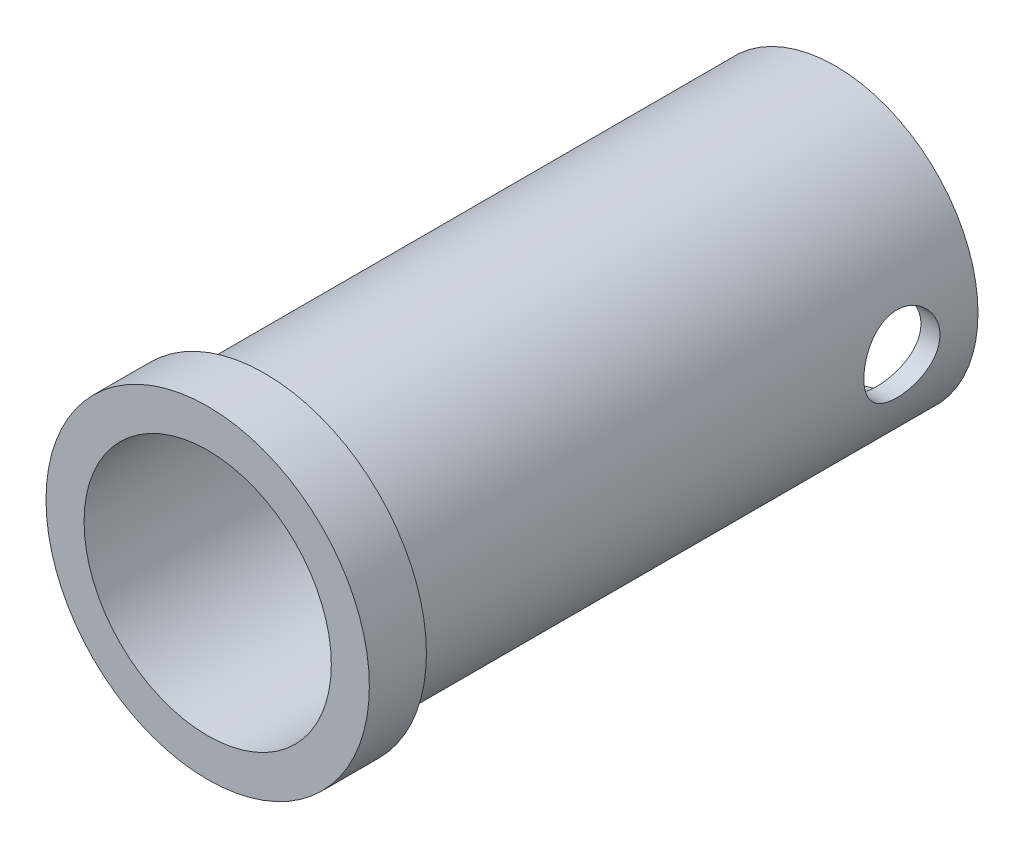
ISO-10303-21;
HEADER;
FILE_DESCRIPTION(('STEP AP214'),'2;1');
FILE_NAME('part.step','',(''),(''),'','','');
FILE_SCHEMA(('AUTOMOTIVE_DESIGN { 1 0 10303 214 1 1 1 1 }'));
ENDSEC;
DATA;
#1=APPLICATION_CONTEXT('core data for automotive mechanical design processes');
#2=APPLICATION_PROTOCOL_DEFINITION('international standard','automotive_design',2000,#1);
#3=PRODUCT_CONTEXT('',#1,'mechanical');
#4=PRODUCT('Part','Part','',(#3));
#5=PRODUCT_RELATED_PRODUCT_CATEGORY('part','',(#4));
#6=PRODUCT_DEFINITION_FORMATION('','',#4);
#7=PRODUCT_DEFINITION_CONTEXT('part definition',#1,'design');
#8=PRODUCT_DEFINITION('design','',#6,#7);
#9=PRODUCT_DEFINITION_SHAPE('','',#8);
#10=(LENGTH_UNIT() NAMED_UNIT(*) SI_UNIT(.MILLI.,.METRE.));
#11=(NAMED_UNIT(*) PLANE_ANGLE_UNIT() SI_UNIT($,.RADIAN.));
#12=(NAMED_UNIT(*) SI_UNIT($,.STERADIAN.) SOLID_ANGLE_UNIT());
#13=UNCERTAINTY_MEASURE_WITH_UNIT(LENGTH_MEASURE(1.E-05),#10,'distance_accuracy_value','');
#14=(GEOMETRIC_REPRESENTATION_CONTEXT(3) GLOBAL_UNCERTAINTY_ASSIGNED_CONTEXT((#13)) GLOBAL_UNIT_ASSIGNED_CONTEXT((#10,
#11,#12)) REPRESENTATION_CONTEXT('',''));
#15=CARTESIAN_POINT('',(0.,0.,0.));
#16=DIRECTION('',(0.,0.,1.));
#17=DIRECTION('',(1.,0.,0.));
#18=AXIS2_PLACEMENT_3D('',#15,#16,#17);
#19=CARTESIAN_POINT('',(0.,0.,0.));
#20=DIRECTION('',(0.,0.,1.));
#21=DIRECTION('',(1.,0.,0.));
#22=AXIS2_PLACEMENT_3D('',#19,#20,#21);
#23=PLANE('',#22);
#24=CARTESIAN_POINT('',(0.,0.,0.));
#25=DIRECTION('',(0.,0.,1.));
#26=DIRECTION('',(1.,0.,0.));
#27=AXIS2_PLACEMENT_3D('',#24,#25,#26);
#28=CIRCLE('',#27,8.5);
#29=CARTESIAN_POINT('',(8.5,0.,0.));
#30=VERTEX_POINT('',#29);
#31=EDGE_CURVE('E49',#30,#30,#28,.T.);
#32=ORIENTED_EDGE('',*,*,#31,.F.);
#33=EDGE_LOOP('',(#32));
#34=FACE_BOUND('',#33,.T.);
#35=CARTESIAN_POINT('',(0.,0.,0.));
#36=DIRECTION('',(0.,0.,1.));
#37=DIRECTION('',(1.,0.,0.));
#38=AXIS2_PLACEMENT_3D('',#35,#36,#37);
#39=CIRCLE('',#38,7.5);
#40=CARTESIAN_POINT('',(7.5,0.,0.));
#41=VERTEX_POINT('',#40);
#42=EDGE_CURVE('E10',#41,#41,#39,.F.);
#43=ORIENTED_EDGE('',*,*,#42,.F.);
#44=EDGE_LOOP('',(#43));
#45=FACE_BOUND('',#44,.T.);
#46=ADVANCED_FACE('F31',(#34,#45),#23,.F.);
#47=CARTESIAN_POINT('',(0.,0.,3.));
#48=DIRECTION('',(0.,0.,1.));
#49=DIRECTION('',(1.,0.,0.));
#50=AXIS2_PLACEMENT_3D('',#47,#48,#49);
#51=PLANE('',#50);
#52=CARTESIAN_POINT('',(0.,0.,3.));
#53=DIRECTION('',(0.,0.,1.));
#54=DIRECTION('',(1.,0.,0.));
#55=AXIS2_PLACEMENT_3D('',#52,#53,#54);
#56=CIRCLE('',#55,8.5);
#57=CARTESIAN_POINT('',(8.5,0.,3.));
#58=VERTEX_POINT('',#57);
#59=EDGE_CURVE('E44',#58,#58,#56,.T.);
#60=ORIENTED_EDGE('',*,*,#59,.T.);
#61=EDGE_LOOP('',(#60));
#62=FACE_BOUND('',#61,.T.);
#63=CARTESIAN_POINT('',(0.,0.,3.));
#64=DIRECTION('',(0.,0.,1.));
#65=DIRECTION('',(1.,0.,0.));
#66=AXIS2_PLACEMENT_3D('',#63,#64,#65);
#67=CIRCLE('',#66,6.5);
#68=CARTESIAN_POINT('',(6.5,0.,3.));
#69=VERTEX_POINT('',#68);
#70=EDGE_CURVE('E99',#69,#69,#67,.T.);
#71=ORIENTED_EDGE('',*,*,#70,.F.);
#72=EDGE_LOOP('',(#71));
#73=FACE_BOUND('',#72,.T.);
#74=ADVANCED_FACE('F87',(#62,#73),#51,.T.);
#75=CARTESIAN_POINT('',(0.,0.,3.));
#76=DIRECTION('',(0.,0.,-1.));
#77=DIRECTION('',(-1.,0.,0.));
#78=AXIS2_PLACEMENT_3D('',#75,#76,#77);
#79=CYLINDRICAL_SURFACE('',#78,8.5);
#80=ORIENTED_EDGE('',*,*,#59,.F.);
#81=EDGE_LOOP('',(#80));
#82=FACE_BOUND('',#81,.T.);
#83=ORIENTED_EDGE('',*,*,#31,.T.);
#84=EDGE_LOOP('',(#83));
#85=FACE_BOUND('',#84,.T.);
#86=ADVANCED_FACE('F33',(#82,#85),#79,.T.);
#87=CARTESIAN_POINT('',(0.,0.,3.));
#88=DIRECTION('',(0.,0.,-1.));
#89=DIRECTION('',(-1.,0.,0.));
#90=AXIS2_PLACEMENT_3D('',#87,#88,#89);
#91=CYLINDRICAL_SURFACE('',#90,6.5);
#92=CARTESIAN_POINT('',(-6.5,0.,-24.));
#93=CARTESIAN_POINT('',(-6.49999929187436,-0.10958647155408,-24.000000960921));
#94=CARTESIAN_POINT('',(-6.49720235792931,-0.219182761349475,-24.0090366476033));
#95=CARTESIAN_POINT('',(-6.48631855265072,-0.435175528984373,-24.0448494119352));
#96=CARTESIAN_POINT('',(-6.47823033671536,-0.541571186300282,-24.0716309991325));
#97=CARTESIAN_POINT('',(-6.45764858487676,-0.748016546984702,-24.1419507068928));
#98=CARTESIAN_POINT('',(-6.44516174661238,-0.848075627090344,-24.1854633607768));
#99=CARTESIAN_POINT('',(-6.41707535917941,-1.03947745536718,-24.2879032073672));
#100=CARTESIAN_POINT('',(-6.40147534884382,-1.13081890919356,-24.3468326842338));
#101=CARTESIAN_POINT('',(-6.36829752406617,-1.30493699247679,-24.4802976754399));
#102=CARTESIAN_POINT('',(-6.35067760587489,-1.38741488565838,-24.5552124192431));
#103=CARTESIAN_POINT('',(-6.31569252815342,-1.53885708269873,-24.717713623508));
#104=CARTESIAN_POINT('',(-6.29832741475793,-1.60781896662595,-24.8053023482719));
#105=CARTESIAN_POINT('',(-6.2653687784566,-1.73187276184925,-24.9932286044274));
#106=CARTESIAN_POINT('',(-6.24982736044083,-1.78659481361997,-25.0938202892978));
#107=CARTESIAN_POINT('',(-6.22290748386974,-1.8782224418158,-25.3033339637373));
#108=CARTESIAN_POINT('',(-6.21152796681115,-1.91513254914664,-25.4122538266544));
#109=CARTESIAN_POINT('',(-6.19466009001291,-1.96900160513189,-25.6319673060524));
#110=CARTESIAN_POINT('',(-6.18900890037713,-1.9865133955599,-25.7426125336073));
#111=CARTESIAN_POINT('',(-6.1837537050085,-2.00281555895419,-25.9654037405724));
#112=CARTESIAN_POINT('',(-6.18414814760279,-2.00161073572821,-26.0775493275175));
#113=CARTESIAN_POINT('',(-6.19079569362891,-1.98094698228321,-26.2956150705989));
#114=CARTESIAN_POINT('',(-6.19682450731138,-1.96218684702854,-26.4016094253222));
#115=CARTESIAN_POINT('',(-6.21369772255051,-1.90807645250928,-26.6088666965969));
#116=CARTESIAN_POINT('',(-6.22454262164885,-1.87272447914839,-26.7101291231058));
#117=CARTESIAN_POINT('',(-6.2500007072195,-1.78593221700801,-26.906730047845));
#118=CARTESIAN_POINT('',(-6.2646654217354,-1.73426970827152,-27.0019634856284));
#119=CARTESIAN_POINT('',(-6.29608673576222,-1.61647725848254,-27.1826405443717));
#120=CARTESIAN_POINT('',(-6.31284386417593,-1.55034365635742,-27.2680816796059));
#121=CARTESIAN_POINT('',(-6.34746551983527,-1.40204114131455,-27.4307043883321));
#122=CARTESIAN_POINT('',(-6.36534631113152,-1.31929416295853,-27.5073562825666));
#123=CARTESIAN_POINT('',(-6.39954830533241,-1.14189770882472,-27.6458222043431));
#124=CARTESIAN_POINT('',(-6.4158693995865,-1.04724740490765,-27.7076351986405));
#125=CARTESIAN_POINT('',(-6.44527556867774,-0.847732923697558,-27.8150129771275));
#126=CARTESIAN_POINT('',(-6.45833594999018,-0.742798718966909,-27.8604548640388));
#127=CARTESIAN_POINT('',(-6.47957102319473,-0.526280934909783,-27.9328862539585));
#128=CARTESIAN_POINT('',(-6.48774715140185,-0.414699321015767,-27.9598811820107));
#129=CARTESIAN_POINT('',(-6.49806290071844,-0.192552832432244,-27.9937580465751));
#130=CARTESIAN_POINT('',(-6.50041772114305,-0.0821071867281244,-28.0013573525657));
#131=CARTESIAN_POINT('',(-6.49946000316609,0.138491178007732,-27.998245233512));
#132=CARTESIAN_POINT('',(-6.49614826472318,0.248643936188298,-27.9875363930629));
#133=CARTESIAN_POINT('',(-6.48437074848215,0.46278580145148,-27.9486895178898));
#134=CARTESIAN_POINT('',(-6.47603039774079,0.566859358780056,-27.9209753528338));
#135=CARTESIAN_POINT('',(-6.45516726536364,0.768852811369361,-27.8494189235729));
#136=CARTESIAN_POINT('',(-6.44264397218779,0.866771952253669,-27.8055746867239));
#137=CARTESIAN_POINT('',(-6.41433382910965,1.05627961444668,-27.7018288051901));
#138=CARTESIAN_POINT('',(-6.39847611273321,1.14766081519562,-27.6415683232348));
#139=CARTESIAN_POINT('',(-6.36531333623025,1.31925606832413,-27.5071331699192));
#140=CARTESIAN_POINT('',(-6.34800789569184,1.39946717074091,-27.432954835024));
#141=CARTESIAN_POINT('',(-6.31306645909658,1.54963528009096,-27.269416700551));
#142=CARTESIAN_POINT('',(-6.29544322340724,1.61908131008096,-27.1795839240507));
#143=CARTESIAN_POINT('',(-6.2625596331719,1.74195487773042,-26.9891566653981));
#144=CARTESIAN_POINT('',(-6.24729923089954,1.79538273895788,-26.8885624006843));
#145=CARTESIAN_POINT('',(-6.22104126828921,1.88435707765314,-26.679721743071));
#146=CARTESIAN_POINT('',(-6.21002584634022,1.9199786710239,-26.571509730227));
#147=CARTESIAN_POINT('',(-6.19358575896332,1.97237526121825,-26.3502173842739));
#148=CARTESIAN_POINT('',(-6.18815904950702,1.98915714872108,-26.237138846834));
#149=CARTESIAN_POINT('',(-6.18371932373484,2.00291323790433,-26.0146519278921));
#150=CARTESIAN_POINT('',(-6.18443554393433,2.00072360720729,-25.9052999954489));
#151=CARTESIAN_POINT('',(-6.19154584982148,1.97860856561739,-25.6886021611527));
#152=CARTESIAN_POINT('',(-6.19793968557834,1.95868393542585,-25.5812561712097));
#153=CARTESIAN_POINT('',(-6.21549850608435,1.90221657867546,-25.3730625714625));
#154=CARTESIAN_POINT('',(-6.22659666514378,1.86590616498311,-25.2721458943152));
#155=CARTESIAN_POINT('',(-6.25229841004041,1.77788001247773,-25.0777564433745));
#156=CARTESIAN_POINT('',(-6.26690269287625,1.72616121006625,-24.9842851546112));
#157=CARTESIAN_POINT('',(-6.29866516433667,1.60648172875982,-24.8035874925195));
#158=CARTESIAN_POINT('',(-6.31589943241281,1.53797752017331,-24.7167345058674));
#159=CARTESIAN_POINT('',(-6.35062263668655,1.38763671757875,-24.5554859330205));
#160=CARTESIAN_POINT('',(-6.36811163907406,1.30579660000224,-24.4810936497135));
#161=CARTESIAN_POINT('',(-6.40203042414331,1.12802317077526,-24.3445508204032));
#162=CARTESIAN_POINT('',(-6.41840990638034,1.03172886568531,-24.2828564246652));
#163=CARTESIAN_POINT('',(-6.44764383058531,0.829631192009801,-24.1766155433475));
#164=CARTESIAN_POINT('',(-6.46049976109691,0.723831864032403,-24.132061813379));
#165=CARTESIAN_POINT('',(-6.48025348346413,0.515929652571419,-24.0648992879398));
#166=CARTESIAN_POINT('',(-6.48759534805451,0.414403258515526,-24.0406305289109));
#167=CARTESIAN_POINT('',(-6.4974684909107,0.208587191828518,-24.0081819406768));
#168=CARTESIAN_POINT('',(-6.50000067395288,0.104298042658335,-23.9999990854512));
#169=CARTESIAN_POINT('',(-6.5,0.,-24.));
#170=B_SPLINE_CURVE_WITH_KNOTS('',3,(#92,#93,#94,#95,#96,#97,#98,#99,#100,#101,#102,#103,#104,
#105,#106,#107,#108,#109,#110,#111,#112,#113,#114,#115,#116,#117,#118,#119,#120,#121,#122,#123,
#124,#125,#126,#127,#128,#129,#130,#131,#132,#133,#134,#135,#136,#137,#138,#139,#140,#141,#142,
#143,#144,#145,#146,#147,#148,#149,#150,#151,#152,#153,#154,#155,#156,#157,#158,#159,#160,#161,
#162,#163,#164,#165,#166,#167,#168,#169),.UNSPECIFIED.,.T.,.F.,(4,2,2,2,2,2,2,2,2,2,2,2,2,2,2,2,
2,2,2,2,2,2,2,2,2,2,2,2,2,2,2,2,2,2,2,2,2,2,4),(0.,0.328376148353204,0.656835774920465,
0.984797413319645,1.31280767013794,1.64969601962052,1.98664463123192,2.33162619975385,
2.67651996741948,3.01130912746221,3.34601236190893,3.66793485951995,3.98989062214147,
4.31643724588171,4.64306657905953,4.98408507994297,5.32512731933628,5.66867887562648,
6.01212935372404,6.34267966649237,6.67318331870837,6.99576592200042,7.31838798898983,
7.64872325349811,7.97914559299322,8.32223487802101,8.66531723215742,9.00693981167226,
9.34843740094788,9.67496275718921,10.0014737403731,10.3234943027839,10.6455789342452,
10.9799294848454,11.3143685200785,11.6592775258489,12.0040405975475,12.3166287634493,
12.6291581207982),.UNSPECIFIED.);
#171=CARTESIAN_POINT('',(-6.5,0.,-24.));
#172=VERTEX_POINT('',#171);
#173=EDGE_CURVE('E77',#172,#172,#170,.T.);
#174=ORIENTED_EDGE('',*,*,#173,.F.);
#175=EDGE_LOOP('',(#174));
#176=FACE_BOUND('',#175,.T.);
#177=CARTESIAN_POINT('',(6.5,0.,-28.));
#178=CARTESIAN_POINT('',(6.49999929187436,-0.10958647155408,-27.999999039079));
#179=CARTESIAN_POINT('',(6.49720235792931,-0.219182761349475,-27.9909633523967));
#180=CARTESIAN_POINT('',(6.48631855265072,-0.435175528984373,-27.9551505880648));
#181=CARTESIAN_POINT('',(6.47823033671536,-0.541571186300282,-27.9283690008675));
#182=CARTESIAN_POINT('',(6.45764858487676,-0.748016546984702,-27.8580492931072));
#183=CARTESIAN_POINT('',(6.44516174661238,-0.848075627090344,-27.8145366392232));
#184=CARTESIAN_POINT('',(6.41707535917941,-1.03947745536718,-27.7120967926328));
#185=CARTESIAN_POINT('',(6.40147534884382,-1.13081890919356,-27.6531673157662));
#186=CARTESIAN_POINT('',(6.36829752406617,-1.30493699247679,-27.5197023245601));
#187=CARTESIAN_POINT('',(6.35067760587489,-1.38741488565838,-27.4447875807569));
#188=CARTESIAN_POINT('',(6.31569252815342,-1.53885708269873,-27.282286376492));
#189=CARTESIAN_POINT('',(6.29832741475793,-1.60781896662595,-27.1946976517281));
#190=CARTESIAN_POINT('',(6.2653687784566,-1.73187276184925,-27.0067713955726));
#191=CARTESIAN_POINT('',(6.24982736044083,-1.78659481361997,-26.9061797107022));
#192=CARTESIAN_POINT('',(6.22290748386974,-1.8782224418158,-26.6966660362627));
#193=CARTESIAN_POINT('',(6.21152796681115,-1.91513254914664,-26.5877461733456));
#194=CARTESIAN_POINT('',(6.19466009001291,-1.96900160513189,-26.3680326939476));
#195=CARTESIAN_POINT('',(6.18900890037713,-1.9865133955599,-26.2573874663927));
#196=CARTESIAN_POINT('',(6.1837537050085,-2.00281555895419,-26.0345962594276));
#197=CARTESIAN_POINT('',(6.18414814760279,-2.00161073572821,-25.9224506724825));
#198=CARTESIAN_POINT('',(6.19079569362891,-1.98094698228321,-25.7043849294011));
#199=CARTESIAN_POINT('',(6.19682450731138,-1.96218684702854,-25.5983905746778));
#200=CARTESIAN_POINT('',(6.21369772255051,-1.90807645250928,-25.3911333034031));
#201=CARTESIAN_POINT('',(6.22454262164885,-1.87272447914839,-25.2898708768942));
#202=CARTESIAN_POINT('',(6.2500007072195,-1.78593221700801,-25.093269952155));
#203=CARTESIAN_POINT('',(6.2646654217354,-1.73426970827152,-24.9980365143716));
#204=CARTESIAN_POINT('',(6.29608673576222,-1.61647725848254,-24.8173594556283));
#205=CARTESIAN_POINT('',(6.31284386417593,-1.55034365635742,-24.7319183203941));
#206=CARTESIAN_POINT('',(6.34746551983527,-1.40204114131455,-24.5692956116679));
#207=CARTESIAN_POINT('',(6.36534631113152,-1.31929416295853,-24.4926437174334));
#208=CARTESIAN_POINT('',(6.39954830533241,-1.14189770882472,-24.3541777956569));
#209=CARTESIAN_POINT('',(6.4158693995865,-1.04724740490765,-24.2923648013595));
#210=CARTESIAN_POINT('',(6.44527556867774,-0.847732923697558,-24.1849870228725));
#211=CARTESIAN_POINT('',(6.45833594999018,-0.742798718966909,-24.1395451359612));
#212=CARTESIAN_POINT('',(6.47957102319473,-0.526280934909783,-24.0671137460415));
#213=CARTESIAN_POINT('',(6.48774715140185,-0.414699321015767,-24.0401188179893));
#214=CARTESIAN_POINT('',(6.49806290071844,-0.192552832432244,-24.0062419534249));
#215=CARTESIAN_POINT('',(6.50041772114305,-0.0821071867281244,-23.9986426474343));
#216=CARTESIAN_POINT('',(6.49946000316609,0.138491178007732,-24.001754766488));
#217=CARTESIAN_POINT('',(6.49614826472318,0.248643936188298,-24.0124636069371));
#218=CARTESIAN_POINT('',(6.48437074848215,0.46278580145148,-24.0513104821102));
#219=CARTESIAN_POINT('',(6.47603039774079,0.566859358780056,-24.0790246471662));
#220=CARTESIAN_POINT('',(6.45516726536364,0.768852811369361,-24.1505810764271));
#221=CARTESIAN_POINT('',(6.44264397218779,0.866771952253669,-24.1944253132761));
#222=CARTESIAN_POINT('',(6.41433382910965,1.05627961444668,-24.2981711948099));
#223=CARTESIAN_POINT('',(6.39847611273321,1.14766081519562,-24.3584316767652));
#224=CARTESIAN_POINT('',(6.36531333623025,1.31925606832413,-24.4928668300808));
#225=CARTESIAN_POINT('',(6.34800789569184,1.39946717074091,-24.567045164976));
#226=CARTESIAN_POINT('',(6.31306645909658,1.54963528009096,-24.730583299449));
#227=CARTESIAN_POINT('',(6.29544322340724,1.61908131008096,-24.8204160759493));
#228=CARTESIAN_POINT('',(6.2625596331719,1.74195487773043,-25.0108433346019));
#229=CARTESIAN_POINT('',(6.24729923089954,1.79538273895788,-25.1114375993157));
#230=CARTESIAN_POINT('',(6.22104126828921,1.88435707765314,-25.320278256929));
#231=CARTESIAN_POINT('',(6.21002584634022,1.9199786710239,-25.428490269773));
#232=CARTESIAN_POINT('',(6.19358575896332,1.97237526121825,-25.6497826157261));
#233=CARTESIAN_POINT('',(6.18815904950702,1.98915714872108,-25.762861153166));
#234=CARTESIAN_POINT('',(6.18371932373484,2.00291323790433,-25.9853480721079));
#235=CARTESIAN_POINT('',(6.18443554393433,2.00072360720729,-26.0947000045511));
#236=CARTESIAN_POINT('',(6.19154584982148,1.97860856561739,-26.3113978388473));
#237=CARTESIAN_POINT('',(6.19793968557834,1.95868393542585,-26.4187438287903));
#238=CARTESIAN_POINT('',(6.21549850608435,1.90221657867546,-26.6269374285375));
#239=CARTESIAN_POINT('',(6.22659666514378,1.86590616498311,-26.7278541056848));
#240=CARTESIAN_POINT('',(6.25229841004041,1.77788001247773,-26.9222435566255));
#241=CARTESIAN_POINT('',(6.26690269287625,1.72616121006625,-27.0157148453888));
#242=CARTESIAN_POINT('',(6.29866516433667,1.60648172875982,-27.1964125074805));
#243=CARTESIAN_POINT('',(6.31589943241281,1.53797752017331,-27.2832654941326));
#244=CARTESIAN_POINT('',(6.35062263668655,1.38763671757875,-27.4445140669795));
#245=CARTESIAN_POINT('',(6.36811163907406,1.30579660000224,-27.5189063502865));
#246=CARTESIAN_POINT('',(6.40203042414331,1.12802317077526,-27.6554491795968));
#247=CARTESIAN_POINT('',(6.41840990638034,1.03172886568531,-27.7171435753348));
#248=CARTESIAN_POINT('',(6.44764383058531,0.829631192009801,-27.8233844566525));
#249=CARTESIAN_POINT('',(6.46049976109691,0.723831864032403,-27.867938186621));
#250=CARTESIAN_POINT('',(6.48025348346413,0.515929652571419,-27.9351007120602));
#251=CARTESIAN_POINT('',(6.48759534805451,0.414403258515526,-27.9593694710891));
#252=CARTESIAN_POINT('',(6.4974684909107,0.208587191828518,-27.9918180593232));
#253=CARTESIAN_POINT('',(6.50000067395288,0.104298042658335,-28.0000009145488));
#254=CARTESIAN_POINT('',(6.5,0.,-28.));
#255=B_SPLINE_CURVE_WITH_KNOTS('',3,(#177,#178,#179,#180,#181,#182,#183,#184,#185,#186,#187,
#188,#189,#190,#191,#192,#193,#194,#195,#196,#197,#198,#199,#200,#201,#202,#203,#204,#205,#206,
#207,#208,#209,#210,#211,#212,#213,#214,#215,#216,#217,#218,#219,#220,#221,#222,#223,#224,#225,
#226,#227,#228,#229,#230,#231,#232,#233,#234,#235,#236,#237,#238,#239,#240,#241,#242,#243,#244,
#245,#246,#247,#248,#249,#250,#251,#252,#253,#254),.UNSPECIFIED.,.T.,.F.,(4,2,2,2,2,2,2,2,2,2,2,
2,2,2,2,2,2,2,2,2,2,2,2,2,2,2,2,2,2,2,2,2,2,2,2,2,2,2,4),(0.,0.328376148353204,
0.656835774920465,0.984797413319645,1.31280767013794,1.64969601962052,1.98664463123192,
2.33162619975385,2.67651996741948,3.01130912746221,3.34601236190893,3.66793485951995,
3.98989062214147,4.31643724588171,4.64306657905953,4.98408507994297,5.32512731933628,
5.66867887562648,6.01212935372404,6.34267966649237,6.67318331870837,6.99576592200042,
7.31838798898983,7.64872325349811,7.97914559299322,8.32223487802101,8.66531723215742,
9.00693981167226,9.34843740094788,9.67496275718921,10.0014737403731,10.3234943027839,
10.6455789342452,10.9799294848454,11.3143685200785,11.6592775258489,12.0040405975475,
12.3166287634493,12.6291581207982),.UNSPECIFIED.);
#256=CARTESIAN_POINT('',(6.5,0.,-28.));
#257=VERTEX_POINT('',#256);
#258=EDGE_CURVE('E72',#257,#257,#255,.T.);
#259=ORIENTED_EDGE('',*,*,#258,.F.);
#260=EDGE_LOOP('',(#259));
#261=FACE_BOUND('',#260,.T.);
#262=ORIENTED_EDGE('',*,*,#70,.T.);
#263=EDGE_LOOP('',(#262));
#264=FACE_BOUND('',#263,.T.);
#265=CARTESIAN_POINT('',(0.,0.,-30.));
#266=DIRECTION('',(0.,0.,-1.));
#267=DIRECTION('',(-1.,0.,0.));
#268=AXIS2_PLACEMENT_3D('',#265,#266,#267);
#269=CIRCLE('',#268,6.5);
#270=CARTESIAN_POINT('',(-6.5,0.,-30.));
#271=VERTEX_POINT('',#270);
#272=EDGE_CURVE('E106',#271,#271,#269,.T.);
#273=ORIENTED_EDGE('',*,*,#272,.T.);
#274=EDGE_LOOP('',(#273));
#275=FACE_BOUND('',#274,.T.);
#276=ADVANCED_FACE('F82',(#176,#261,#264,#275),#91,.F.);
#277=CARTESIAN_POINT('',(0.,0.,-30.));
#278=DIRECTION('',(0.,0.,-1.));
#279=DIRECTION('',(-1.,0.,0.));
#280=AXIS2_PLACEMENT_3D('',#277,#278,#279);
#281=PLANE('',#280);
#282=CARTESIAN_POINT('',(0.,0.,-30.));
#283=DIRECTION('',(0.,0.,-1.));
#284=DIRECTION('',(-1.,0.,0.));
#285=AXIS2_PLACEMENT_3D('',#282,#283,#284);
#286=CIRCLE('',#285,7.5);
#287=CARTESIAN_POINT('',(-7.5,0.,-30.));
#288=VERTEX_POINT('',#287);
#289=EDGE_CURVE('E101',#288,#288,#286,.T.);
#290=ORIENTED_EDGE('',*,*,#289,.T.);
#291=EDGE_LOOP('',(#290));
#292=FACE_BOUND('',#291,.T.);
#293=ORIENTED_EDGE('',*,*,#272,.F.);
#294=EDGE_LOOP('',(#293));
#295=FACE_BOUND('',#294,.T.);
#296=ADVANCED_FACE('F66',(#292,#295),#281,.T.);
#297=CARTESIAN_POINT('',(0.,0.,-30.));
#298=DIRECTION('',(0.,0.,1.));
#299=DIRECTION('',(1.,0.,0.));
#300=AXIS2_PLACEMENT_3D('',#297,#298,#299);
#301=CYLINDRICAL_SURFACE('',#300,7.5);
#302=CARTESIAN_POINT('',(7.5,0.,-28.));
#303=CARTESIAN_POINT('',(7.49999833810161,-0.110254555832854,-27.9999973830651));
#304=CARTESIAN_POINT('',(7.49754486162151,-0.220537160221841,-27.9908523858103));
#305=CARTESIAN_POINT('',(7.48799573621659,-0.437925451354464,-27.9545787692613));
#306=CARTESIAN_POINT('',(7.48089785332586,-0.545029583319087,-27.9274414955739));
#307=CARTESIAN_POINT('',(7.4628433325279,-0.752891589045313,-27.856128333136));
#308=CARTESIAN_POINT('',(7.45189167130375,-0.853657451015286,-27.811974412334));
#309=CARTESIAN_POINT('',(7.42728699151678,-1.04635368639266,-27.7079627573334));
#310=CARTESIAN_POINT('',(7.4136337929518,-1.13828347044963,-27.6481039766407));
#311=CARTESIAN_POINT('',(7.38474614901995,-1.31282950374002,-27.5129164835866));
#312=CARTESIAN_POINT('',(7.36948467678681,-1.39521168986279,-27.4372913319917));
#313=CARTESIAN_POINT('',(7.33927409679591,-1.54628713660638,-27.2733515169366));
#314=CARTESIAN_POINT('',(7.32432502947243,-1.61497863495665,-27.1850352223825));
#315=CARTESIAN_POINT('',(7.29615537464372,-1.73786409243415,-26.9963517651746));
#316=CARTESIAN_POINT('',(7.28296888563238,-1.79178877736488,-26.8958036717383));
#317=CARTESIAN_POINT('',(7.26021477318187,-1.88187548076994,-26.6866598889076));
#318=CARTESIAN_POINT('',(7.25064648253265,-1.91804077451369,-26.5780656876686));
#319=CARTESIAN_POINT('',(7.23649115802399,-1.97076920226504,-26.358504462175));
#320=CARTESIAN_POINT('',(7.2317964781149,-1.98775670244692,-26.2476464600693));
#321=CARTESIAN_POINT('',(7.2275983091637,-2.0029703470582,-26.0245623166935));
#322=CARTESIAN_POINT('',(7.22809385014446,-2.00119999705754,-25.9123364349759));
#323=CARTESIAN_POINT('',(7.2341237880203,-1.97928510002699,-25.6930145846259));
#324=CARTESIAN_POINT('',(7.23951735511531,-1.95965406064765,-25.5858628179615));
#325=CARTESIAN_POINT('',(7.25451013080688,-1.90339748722183,-25.3764316655438));
#326=CARTESIAN_POINT('',(7.26410967552612,-1.86677059492995,-25.2741526699246));
#327=CARTESIAN_POINT('',(7.28655661748386,-1.77714356965256,-25.0760318561914));
#328=CARTESIAN_POINT('',(7.29943942818703,-1.72396341137785,-24.9802756607137));
#329=CARTESIAN_POINT('',(7.32698229642445,-1.60286503823778,-24.7988658411485));
#330=CARTESIAN_POINT('',(7.34164270355186,-1.53494392224252,-24.7132142108435));
#331=CARTESIAN_POINT('',(7.37167510629864,-1.38366607263419,-24.5515110025452));
#332=CARTESIAN_POINT('',(7.38705471488831,-1.29987812728299,-24.475863681685));
#333=CARTESIAN_POINT('',(7.41636381276316,-1.12061766820637,-24.3396112196497));
#334=CARTESIAN_POINT('',(7.43029324488555,-1.02514469420509,-24.2790066712976));
#335=CARTESIAN_POINT('',(7.45521820398293,-0.824598255497453,-24.1743820971753));
#336=CARTESIAN_POINT('',(7.4662007283356,-0.719484902551791,-24.1304352295514));
#337=CARTESIAN_POINT('',(7.48390044400999,-0.503002294390398,-24.0609528111866));
#338=CARTESIAN_POINT('',(7.49061856733749,-0.391634411928326,-24.035413237276));
#339=CARTESIAN_POINT('',(7.49889158558384,-0.169254083145517,-24.0041051230822));
#340=CARTESIAN_POINT('',(7.50058997470959,-0.0583242376413814,-23.9977869601491));
#341=CARTESIAN_POINT('',(7.49904471691695,0.163010045901199,-24.0035831642469));
#342=CARTESIAN_POINT('',(7.49580158080353,0.273414537062114,-24.0156956261058));
#343=CARTESIAN_POINT('',(7.48483035496021,0.488602449901781,-24.05755844746));
#344=CARTESIAN_POINT('',(7.47718026546329,0.593449852027784,-24.0870022461978));
#345=CARTESIAN_POINT('',(7.45826294894139,0.796706971176067,-24.1623359445079));
#346=CARTESIAN_POINT('',(7.44699532996161,0.895115989216029,-24.2082276262505));
#347=CARTESIAN_POINT('',(7.42175660559528,1.08483847466795,-24.3161738871805));
#348=CARTESIAN_POINT('',(7.40773686604957,1.17597518846118,-24.3785274667977));
#349=CARTESIAN_POINT('',(7.37861452365563,1.34668463539715,-24.517251630158));
#350=CARTESIAN_POINT('',(7.3635117072752,1.42625507879918,-24.593624982601));
#351=CARTESIAN_POINT('',(7.33339745866704,1.57388924478774,-24.7607855774946));
#352=CARTESIAN_POINT('',(7.31840061429312,1.64156519249816,-24.8519185613952));
#353=CARTESIAN_POINT('',(7.29066447182727,1.76067191185119,-25.0445646960996));
#354=CARTESIAN_POINT('',(7.27792507956316,1.81210336122161,-25.1460774136223));
#355=CARTESIAN_POINT('',(7.2562926837321,1.89687411586113,-25.3560953070761));
#356=CARTESIAN_POINT('',(7.24737748318009,1.93031812253958,-25.4645558118176));
#357=CARTESIAN_POINT('',(7.234398251268,1.97841205118791,-25.6858393196747));
#358=CARTESIAN_POINT('',(7.23033298020014,1.99306677602478,-25.7986612003479));
#359=CARTESIAN_POINT('',(7.22761744573588,2.00288989653714,-26.0214947878838));
#360=CARTESIAN_POINT('',(7.22879397743239,1.99868155618109,-26.1314773202583));
#361=CARTESIAN_POINT('',(7.23602396081087,1.97234376000439,-26.34910351401));
#362=CARTESIAN_POINT('',(7.24207728699439,1.95021476535026,-26.4567472355006));
#363=CARTESIAN_POINT('',(7.25827571073158,1.88902515699699,-26.6658557521299));
#364=CARTESIAN_POINT('',(7.26838885019644,1.8500966107558,-26.7673618427322));
#365=CARTESIAN_POINT('',(7.29156818136177,1.75651554562386,-26.9624788305341));
#366=CARTESIAN_POINT('',(7.30463483621364,1.70186056024617,-27.0560884863005));
#367=CARTESIAN_POINT('',(7.3327292144046,1.57648909268817,-27.2357303594966));
#368=CARTESIAN_POINT('',(7.3478033310169,1.5053472976791,-27.3214585349762));
#369=CARTESIAN_POINT('',(7.37795503783007,1.349830535111,-27.4799624516673));
#370=CARTESIAN_POINT('',(7.39303262798441,1.26545235435875,-27.5527350386688));
#371=CARTESIAN_POINT('',(7.42187812403968,1.08367998108869,-27.6847922376469));
#372=CARTESIAN_POINT('',(7.43561111314551,0.986045961751781,-27.7437550106493));
#373=CARTESIAN_POINT('',(7.45983810102897,0.78188864041689,-27.8443374159294));
#374=CARTESIAN_POINT('',(7.47033417683594,0.675371094696298,-27.8859681756636));
#375=CARTESIAN_POINT('',(7.48554752513468,0.474374704880992,-27.9452752854155));
#376=CARTESIAN_POINT('',(7.49092770592602,0.380762016565037,-27.9657493835925));
#377=CARTESIAN_POINT('',(7.49815449036456,0.191439795317077,-27.9931122061671));
#378=CARTESIAN_POINT('',(7.5000014429727,0.0957304704048606,-28.0000022722));
#379=CARTESIAN_POINT('',(7.5,0.,-28.));
#380=B_SPLINE_CURVE_WITH_KNOTS('',3,(#302,#303,#304,#305,#306,#307,#308,#309,#310,#311,#312,
#313,#314,#315,#316,#317,#318,#319,#320,#321,#322,#323,#324,#325,#326,#327,#328,#329,#330,#331,
#332,#333,#334,#335,#336,#337,#338,#339,#340,#341,#342,#343,#344,#345,#346,#347,#348,#349,#350,
#351,#352,#353,#354,#355,#356,#357,#358,#359,#360,#361,#362,#363,#364,#365,#366,#367,#368,#369,
#370,#371,#372,#373,#374,#375,#376,#377,#378,#379),.UNSPECIFIED.,.T.,.F.,(4,2,2,2,2,2,2,2,2,2,2,
2,2,2,2,2,2,2,2,2,2,2,2,2,2,2,2,2,2,2,2,2,2,2,2,2,2,2,4),(0.,0.330412598949569,0.66098424376145,
0.991130552971933,1.32129886708675,1.65834897954967,1.99544244925149,2.33832582523229,
2.681145941297,3.01622158250468,3.3512346040432,3.67691002045997,4.0026114681294,
4.33198673346499,4.6614268811763,5.00161259812322,5.34181171937598,5.68348809603042,
6.02508977190139,6.35682717524548,6.68853028925352,7.01453535642117,7.34057575775615,
7.67300286004551,8.00549568258888,8.34736496382789,8.68921998024109,9.02906297699388,
9.36881908663984,9.69743342403613,10.026039305206,10.352107654483,10.67822717123,
11.0139433957139,11.3497412433245,11.692722522809,12.0354832614518,12.3223981899334,
12.6092847796638),.UNSPECIFIED.);
#381=CARTESIAN_POINT('',(7.5,0.,-28.));
#382=VERTEX_POINT('',#381);
#383=EDGE_CURVE('E35',#382,#382,#380,.T.);
#384=ORIENTED_EDGE('',*,*,#383,.T.);
#385=EDGE_LOOP('',(#384));
#386=FACE_BOUND('',#385,.T.);
#387=CARTESIAN_POINT('',(-7.5,0.,-28.));
#388=CARTESIAN_POINT('',(-7.49999833810161,0.110254555832854,-27.9999973830651));
#389=CARTESIAN_POINT('',(-7.49754486162151,0.220537160221841,-27.9908523858103));
#390=CARTESIAN_POINT('',(-7.48799573621659,0.437925451354464,-27.9545787692613));
#391=CARTESIAN_POINT('',(-7.48089785332586,0.545029583319087,-27.9274414955739));
#392=CARTESIAN_POINT('',(-7.4628433325279,0.752891589045313,-27.856128333136));
#393=CARTESIAN_POINT('',(-7.45189167130375,0.853657451015286,-27.811974412334));
#394=CARTESIAN_POINT('',(-7.42728699151678,1.04635368639266,-27.7079627573334));
#395=CARTESIAN_POINT('',(-7.4136337929518,1.13828347044963,-27.6481039766407));
#396=CARTESIAN_POINT('',(-7.38474614901995,1.31282950374002,-27.5129164835866));
#397=CARTESIAN_POINT('',(-7.36948467678681,1.39521168986279,-27.4372913319917));
#398=CARTESIAN_POINT('',(-7.33927409679591,1.54628713660638,-27.2733515169366));
#399=CARTESIAN_POINT('',(-7.32432502947243,1.61497863495665,-27.1850352223825));
#400=CARTESIAN_POINT('',(-7.29615537464372,1.73786409243415,-26.9963517651746));
#401=CARTESIAN_POINT('',(-7.28296888563238,1.79178877736488,-26.8958036717383));
#402=CARTESIAN_POINT('',(-7.26021477318187,1.88187548076994,-26.6866598889076));
#403=CARTESIAN_POINT('',(-7.25064648253265,1.91804077451369,-26.5780656876686));
#404=CARTESIAN_POINT('',(-7.23649115802399,1.97076920226504,-26.358504462175));
#405=CARTESIAN_POINT('',(-7.2317964781149,1.98775670244692,-26.2476464600693));
#406=CARTESIAN_POINT('',(-7.2275983091637,2.0029703470582,-26.0245623166935));
#407=CARTESIAN_POINT('',(-7.22809385014446,2.00119999705754,-25.9123364349759));
#408=CARTESIAN_POINT('',(-7.2341237880203,1.97928510002699,-25.6930145846259));
#409=CARTESIAN_POINT('',(-7.23951735511531,1.95965406064765,-25.5858628179615));
#410=CARTESIAN_POINT('',(-7.25451013080688,1.90339748722183,-25.3764316655438));
#411=CARTESIAN_POINT('',(-7.26410967552612,1.86677059492995,-25.2741526699246));
#412=CARTESIAN_POINT('',(-7.28655661748386,1.77714356965256,-25.0760318561914));
#413=CARTESIAN_POINT('',(-7.29943942818703,1.72396341137785,-24.9802756607137));
#414=CARTESIAN_POINT('',(-7.32698229642445,1.60286503823778,-24.7988658411485));
#415=CARTESIAN_POINT('',(-7.34164270355186,1.53494392224252,-24.7132142108435));
#416=CARTESIAN_POINT('',(-7.37167510629864,1.38366607263419,-24.5515110025452));
#417=CARTESIAN_POINT('',(-7.38705471488831,1.29987812728299,-24.475863681685));
#418=CARTESIAN_POINT('',(-7.41636381276316,1.12061766820637,-24.3396112196497));
#419=CARTESIAN_POINT('',(-7.43029324488555,1.02514469420509,-24.2790066712976));
#420=CARTESIAN_POINT('',(-7.45521820398293,0.824598255497453,-24.1743820971753));
#421=CARTESIAN_POINT('',(-7.4662007283356,0.719484902551791,-24.1304352295514));
#422=CARTESIAN_POINT('',(-7.48390044400999,0.503002294390398,-24.0609528111866));
#423=CARTESIAN_POINT('',(-7.49061856733749,0.391634411928326,-24.035413237276));
#424=CARTESIAN_POINT('',(-7.49889158558384,0.169254083145517,-24.0041051230822));
#425=CARTESIAN_POINT('',(-7.50058997470959,0.0583242376413814,-23.9977869601491));
#426=CARTESIAN_POINT('',(-7.49904471691695,-0.163010045901199,-24.0035831642469));
#427=CARTESIAN_POINT('',(-7.49580158080353,-0.273414537062114,-24.0156956261058));
#428=CARTESIAN_POINT('',(-7.48483035496021,-0.488602449901781,-24.05755844746));
#429=CARTESIAN_POINT('',(-7.47718026546329,-0.593449852027784,-24.0870022461978));
#430=CARTESIAN_POINT('',(-7.45826294894139,-0.796706971176067,-24.1623359445079));
#431=CARTESIAN_POINT('',(-7.44699532996161,-0.895115989216029,-24.2082276262505));
#432=CARTESIAN_POINT('',(-7.42175660559528,-1.08483847466795,-24.3161738871805));
#433=CARTESIAN_POINT('',(-7.40773686604957,-1.17597518846118,-24.3785274667977));
#434=CARTESIAN_POINT('',(-7.37861452365563,-1.34668463539715,-24.517251630158));
#435=CARTESIAN_POINT('',(-7.3635117072752,-1.42625507879918,-24.593624982601));
#436=CARTESIAN_POINT('',(-7.33339745866704,-1.57388924478774,-24.7607855774946));
#437=CARTESIAN_POINT('',(-7.31840061429312,-1.64156519249816,-24.8519185613952));
#438=CARTESIAN_POINT('',(-7.29066447182727,-1.76067191185119,-25.0445646960996));
#439=CARTESIAN_POINT('',(-7.27792507956316,-1.81210336122161,-25.1460774136223));
#440=CARTESIAN_POINT('',(-7.2562926837321,-1.89687411586113,-25.3560953070761));
#441=CARTESIAN_POINT('',(-7.24737748318009,-1.93031812253958,-25.4645558118176));
#442=CARTESIAN_POINT('',(-7.234398251268,-1.97841205118791,-25.6858393196747));
#443=CARTESIAN_POINT('',(-7.23033298020014,-1.99306677602478,-25.7986612003479));
#444=CARTESIAN_POINT('',(-7.22761744573588,-2.00288989653714,-26.0214947878838));
#445=CARTESIAN_POINT('',(-7.22879397743239,-1.99868155618109,-26.1314773202583));
#446=CARTESIAN_POINT('',(-7.23602396081087,-1.97234376000439,-26.34910351401));
#447=CARTESIAN_POINT('',(-7.24207728699439,-1.95021476535026,-26.4567472355006));
#448=CARTESIAN_POINT('',(-7.25827571073158,-1.88902515699699,-26.6658557521299));
#449=CARTESIAN_POINT('',(-7.26838885019644,-1.8500966107558,-26.7673618427322));
#450=CARTESIAN_POINT('',(-7.29156818136177,-1.75651554562386,-26.9624788305341));
#451=CARTESIAN_POINT('',(-7.30463483621364,-1.70186056024617,-27.0560884863005));
#452=CARTESIAN_POINT('',(-7.3327292144046,-1.57648909268817,-27.2357303594966));
#453=CARTESIAN_POINT('',(-7.3478033310169,-1.5053472976791,-27.3214585349762));
#454=CARTESIAN_POINT('',(-7.37795503783007,-1.349830535111,-27.4799624516673));
#455=CARTESIAN_POINT('',(-7.39303262798441,-1.26545235435875,-27.5527350386688));
#456=CARTESIAN_POINT('',(-7.42187812403968,-1.08367998108869,-27.6847922376469));
#457=CARTESIAN_POINT('',(-7.43561111314551,-0.986045961751781,-27.7437550106493));
#458=CARTESIAN_POINT('',(-7.45983810102897,-0.78188864041689,-27.8443374159294));
#459=CARTESIAN_POINT('',(-7.47033417683594,-0.675371094696298,-27.8859681756636));
#460=CARTESIAN_POINT('',(-7.48554752513468,-0.474374704880992,-27.9452752854155));
#461=CARTESIAN_POINT('',(-7.49092770592602,-0.380762016565037,-27.9657493835925));
#462=CARTESIAN_POINT('',(-7.49815449036456,-0.191439795317077,-27.9931122061671));
#463=CARTESIAN_POINT('',(-7.5000014429727,-0.0957304704048606,-28.0000022722));
#464=CARTESIAN_POINT('',(-7.5,0.,-28.));
#465=B_SPLINE_CURVE_WITH_KNOTS('',3,(#387,#388,#389,#390,#391,#392,#393,#394,#395,#396,#397,
#398,#399,#400,#401,#402,#403,#404,#405,#406,#407,#408,#409,#410,#411,#412,#413,#414,#415,#416,
#417,#418,#419,#420,#421,#422,#423,#424,#425,#426,#427,#428,#429,#430,#431,#432,#433,#434,#435,
#436,#437,#438,#439,#440,#441,#442,#443,#444,#445,#446,#447,#448,#449,#450,#451,#452,#453,#454,
#455,#456,#457,#458,#459,#460,#461,#462,#463,#464),.UNSPECIFIED.,.T.,.F.,(4,2,2,2,2,2,2,2,2,2,2,
2,2,2,2,2,2,2,2,2,2,2,2,2,2,2,2,2,2,2,2,2,2,2,2,2,2,2,4),(0.,0.330412598949569,0.66098424376145,
0.991130552971933,1.32129886708675,1.65834897954967,1.99544244925149,2.33832582523229,
2.681145941297,3.01622158250468,3.3512346040432,3.67691002045997,4.0026114681294,
4.33198673346499,4.6614268811763,5.00161259812322,5.34181171937598,5.68348809603042,
6.02508977190139,6.35682717524548,6.68853028925352,7.01453535642117,7.34057575775615,
7.67300286004551,8.00549568258888,8.34736496382789,8.68921998024109,9.02906297699388,
9.36881908663984,9.69743342403613,10.026039305206,10.352107654483,10.67822717123,
11.0139433957139,11.3497412433245,11.692722522809,12.0354832614518,12.3223981899334,
12.6092847796638),.UNSPECIFIED.);
#466=CARTESIAN_POINT('',(-7.5,0.,-28.));
#467=VERTEX_POINT('',#466);
#468=EDGE_CURVE('E52',#467,#467,#465,.T.);
#469=ORIENTED_EDGE('',*,*,#468,.T.);
#470=EDGE_LOOP('',(#469));
#471=FACE_BOUND('',#470,.T.);
#472=ORIENTED_EDGE('',*,*,#289,.F.);
#473=EDGE_LOOP('',(#472));
#474=FACE_BOUND('',#473,.T.);
#475=ORIENTED_EDGE('',*,*,#42,.T.);
#476=EDGE_LOOP('',(#475));
#477=FACE_BOUND('',#476,.T.);
#478=ADVANCED_FACE('F57',(#386,#471,#474,#477),#301,.T.);
#479=CARTESIAN_POINT('',(-8.5,0.,-26.));
#480=DIRECTION('',(1.,0.,0.));
#481=DIRECTION('',(0.,0.,-1.));
#482=AXIS2_PLACEMENT_3D('',#479,#480,#481);
#483=CYLINDRICAL_SURFACE('',#482,2.);
#484=ORIENTED_EDGE('',*,*,#173,.T.);
#485=EDGE_LOOP('',(#484));
#486=FACE_BOUND('',#485,.T.);
#487=ORIENTED_EDGE('',*,*,#468,.F.);
#488=EDGE_LOOP('',(#487));
#489=FACE_BOUND('',#488,.T.);
#490=ADVANCED_FACE('F61',(#486,#489),#483,.F.);
#491=ORIENTED_EDGE('',*,*,#258,.T.);
#492=EDGE_LOOP('',(#491));
#493=FACE_BOUND('',#492,.T.);
#494=ORIENTED_EDGE('',*,*,#383,.F.);
#495=EDGE_LOOP('',(#494));
#496=FACE_BOUND('',#495,.T.);
#497=ADVANCED_FACE('F64',(#493,#496),#483,.F.);
#498=CLOSED_SHELL('',(#46,#74,#86,#276,#296,#478,#490,#497));
#499=MANIFOLD_SOLID_BREP('B2',#498);
#500=ADVANCED_BREP_SHAPE_REPRESENTATION('',(#18,#499),#14);
#501=SHAPE_DEFINITION_REPRESENTATION(#9,#500);
ENDSEC;
END-ISO-10303-21;
